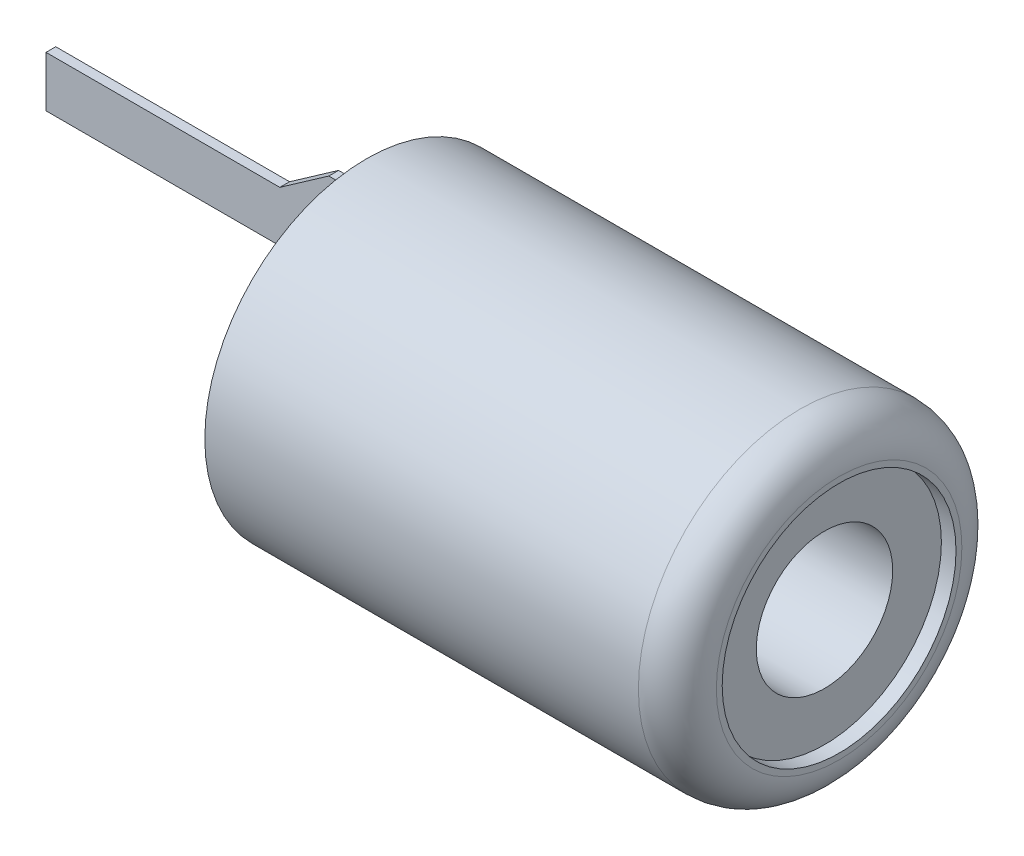
ISO-10303-21;
HEADER;
FILE_DESCRIPTION(('STEP AP214'),'2;1');
FILE_NAME('part.step','',(''),(''),'','','');
FILE_SCHEMA(('AUTOMOTIVE_DESIGN { 1 0 10303 214 1 1 1 1 }'));
ENDSEC;
DATA;
#1=APPLICATION_CONTEXT('core data for automotive mechanical design processes');
#2=APPLICATION_PROTOCOL_DEFINITION('international standard','automotive_design',2000,#1);
#3=PRODUCT_CONTEXT('',#1,'mechanical');
#4=PRODUCT('Part','Part','',(#3));
#5=PRODUCT_RELATED_PRODUCT_CATEGORY('part','',(#4));
#6=PRODUCT_DEFINITION_FORMATION('','',#4);
#7=PRODUCT_DEFINITION_CONTEXT('part definition',#1,'design');
#8=PRODUCT_DEFINITION('design','',#6,#7);
#9=PRODUCT_DEFINITION_SHAPE('','',#8);
#10=(LENGTH_UNIT() NAMED_UNIT(*) SI_UNIT(.MILLI.,.METRE.));
#11=(NAMED_UNIT(*) PLANE_ANGLE_UNIT() SI_UNIT($,.RADIAN.));
#12=(NAMED_UNIT(*) SI_UNIT($,.STERADIAN.) SOLID_ANGLE_UNIT());
#13=UNCERTAINTY_MEASURE_WITH_UNIT(LENGTH_MEASURE(1.E-05),#10,'distance_accuracy_value','');
#14=(GEOMETRIC_REPRESENTATION_CONTEXT(3) GLOBAL_UNCERTAINTY_ASSIGNED_CONTEXT((#13)) GLOBAL_UNIT_ASSIGNED_CONTEXT((#10,
#11,#12)) REPRESENTATION_CONTEXT('',''));
#15=CARTESIAN_POINT('',(0.,0.,0.));
#16=DIRECTION('',(0.,0.,1.));
#17=DIRECTION('',(1.,0.,0.));
#18=AXIS2_PLACEMENT_3D('',#15,#16,#17);
#19=CARTESIAN_POINT('',(12.3749268721822,0.,0.));
#20=DIRECTION('',(1.,0.,0.));
#21=DIRECTION('',(0.,0.,-1.));
#22=AXIS2_PLACEMENT_3D('',#19,#20,#21);
#23=CYLINDRICAL_SURFACE('',#22,3.77500000000004);
#24=CARTESIAN_POINT('',(21.7250000000001,0.,0.));
#25=DIRECTION('',(1.,0.,0.));
#26=DIRECTION('',(0.,0.,-1.));
#27=AXIS2_PLACEMENT_3D('',#24,#25,#26);
#28=CIRCLE('',#27,3.77500000000004);
#29=CARTESIAN_POINT('',(21.7250000000001,0.,-3.77500000000004));
#30=VERTEX_POINT('',#29);
#31=EDGE_CURVE('P0_E17',#30,#30,#28,.T.);
#32=ORIENTED_EDGE('',*,*,#31,.F.);
#33=EDGE_LOOP('',(#32));
#34=FACE_BOUND('',#33,.T.);
#35=CARTESIAN_POINT('',(21.1,0.,0.));
#36=DIRECTION('',(1.,0.,0.));
#37=DIRECTION('',(0.,0.,-1.));
#38=AXIS2_PLACEMENT_3D('',#35,#36,#37);
#39=CIRCLE('',#38,3.775);
#40=CARTESIAN_POINT('',(21.1,0.,-3.775));
#41=VERTEX_POINT('',#40);
#42=EDGE_CURVE('P0_E21',#41,#41,#39,.T.);
#43=ORIENTED_EDGE('',*,*,#42,.T.);
#44=EDGE_LOOP('',(#43));
#45=FACE_BOUND('',#44,.T.);
#46=ADVANCED_FACE('P0_F14',(#34,#45),#23,.T.);
#47=CARTESIAN_POINT('',(21.7250000000001,3.77500000000004,0.));
#48=DIRECTION('',(1.,0.,0.));
#49=DIRECTION('',(0.,0.,-1.));
#50=AXIS2_PLACEMENT_3D('',#47,#48,#49);
#51=PLANE('',#50);
#52=CARTESIAN_POINT('',(21.725,0.,0.));
#53=DIRECTION('',(1.,0.,0.));
#54=DIRECTION('',(0.,0.,1.));
#55=AXIS2_PLACEMENT_3D('',#52,#53,#54);
#56=CIRCLE('',#55,3.15);
#57=CARTESIAN_POINT('',(21.725,0.,3.15));
#58=VERTEX_POINT('',#57);
#59=EDGE_CURVE('P0_E10',#58,#58,#56,.F.);
#60=ORIENTED_EDGE('',*,*,#59,.T.);
#61=EDGE_LOOP('',(#60));
#62=FACE_BOUND('',#61,.T.);
#63=ORIENTED_EDGE('',*,*,#31,.T.);
#64=EDGE_LOOP('',(#63));
#65=FACE_BOUND('',#64,.T.);
#66=ADVANCED_FACE('P0_F44',(#62,#65),#51,.T.);
#67=CARTESIAN_POINT('',(21.1,0.,0.));
#68=DIRECTION('',(1.,0.,0.));
#69=DIRECTION('',(0.,0.,-1.));
#70=AXIS2_PLACEMENT_3D('',#67,#68,#69);
#71=TOROIDAL_SURFACE('',#70,3.15,0.625);
#72=ORIENTED_EDGE('',*,*,#59,.F.);
#73=EDGE_LOOP('',(#72));
#74=FACE_BOUND('',#73,.T.);
#75=ORIENTED_EDGE('',*,*,#42,.F.);
#76=EDGE_LOOP('',(#75));
#77=FACE_BOUND('',#76,.T.);
#78=ADVANCED_FACE('P0_F35',(#74,#77),#71,.F.);
#79=CLOSED_SHELL('',(#46,#66,#78));
#80=MANIFOLD_SOLID_BREP('P0_B1',#79);
#81=CARTESIAN_POINT('',(0.,-1.53,-1.75));
#82=DIRECTION('',(0.,0.,-1.));
#83=DIRECTION('',(-1.,0.,0.));
#84=AXIS2_PLACEMENT_3D('',#81,#82,#83);
#85=PLANE('',#84);
#86=DIRECTION('',(1.,0.,0.));
#87=VECTOR('',#86,1.);
#88=CARTESIAN_POINT('',(0.,0.65,-1.75));
#89=LINE('',#88,#87);
#90=CARTESIAN_POINT('',(0.,0.65,-1.75));
#91=VERTEX_POINT('',#90);
#92=CARTESIAN_POINT('',(6.,0.649999999999999,-1.75));
#93=VERTEX_POINT('',#92);
#94=EDGE_CURVE('P1_E77',#91,#93,#89,.T.);
#95=ORIENTED_EDGE('',*,*,#94,.F.);
#96=DIRECTION('',(0.,1.,0.));
#97=VECTOR('',#96,1.);
#98=CARTESIAN_POINT('',(0.,1.53,-1.75));
#99=LINE('',#98,#97);
#100=CARTESIAN_POINT('',(0.,-0.65,-1.75));
#101=VERTEX_POINT('',#100);
#102=EDGE_CURVE('P1_E130',#101,#91,#99,.T.);
#103=ORIENTED_EDGE('',*,*,#102,.F.);
#104=DIRECTION('',(1.,0.,0.));
#105=VECTOR('',#104,1.);
#106=CARTESIAN_POINT('',(0.,-0.65,-1.75));
#107=LINE('',#106,#105);
#108=CARTESIAN_POINT('',(6.,-0.65,-1.75));
#109=VERTEX_POINT('',#108);
#110=EDGE_CURVE('P1_E127',#109,#101,#107,.F.);
#111=ORIENTED_EDGE('',*,*,#110,.F.);
#112=DIRECTION('',(0.81915204428899,-0.573576436351048,0.));
#113=VECTOR('',#112,1.);
#114=CARTESIAN_POINT('',(6.,-0.65,-1.75));
#115=LINE('',#114,#113);
#116=CARTESIAN_POINT('',(7.25677024593306,-1.53,-1.75));
#117=VERTEX_POINT('',#116);
#118=EDGE_CURVE('P1_E51',#117,#109,#115,.F.);
#119=ORIENTED_EDGE('',*,*,#118,.F.);
#120=DIRECTION('',(1.,0.,0.));
#121=VECTOR('',#120,1.);
#122=CARTESIAN_POINT('',(0.,-1.53,-1.75));
#123=LINE('',#122,#121);
#124=CARTESIAN_POINT('',(9.975,-1.53,-1.75));
#125=VERTEX_POINT('',#124);
#126=EDGE_CURVE('P1_E123',#117,#125,#123,.T.);
#127=ORIENTED_EDGE('',*,*,#126,.T.);
#128=DIRECTION('',(0.,1.,0.));
#129=VECTOR('',#128,1.);
#130=CARTESIAN_POINT('',(9.975,0.,-1.75));
#131=LINE('',#130,#129);
#132=CARTESIAN_POINT('',(9.975,1.53,-1.75));
#133=VERTEX_POINT('',#132);
#134=EDGE_CURVE('P1_E18',#133,#125,#131,.F.);
#135=ORIENTED_EDGE('',*,*,#134,.F.);
#136=DIRECTION('',(1.,0.,0.));
#137=VECTOR('',#136,1.);
#138=CARTESIAN_POINT('',(0.,1.53,-1.75));
#139=LINE('',#138,#137);
#140=CARTESIAN_POINT('',(7.25677024593305,1.53,-1.75));
#141=VERTEX_POINT('',#140);
#142=EDGE_CURVE('P1_E80',#133,#141,#139,.F.);
#143=ORIENTED_EDGE('',*,*,#142,.T.);
#144=DIRECTION('',(0.81915204428899,0.573576436351048,0.));
#145=VECTOR('',#144,1.);
#146=CARTESIAN_POINT('',(6.,0.65,-1.75));
#147=LINE('',#146,#145);
#148=EDGE_CURVE('P1_E75',#93,#141,#147,.T.);
#149=ORIENTED_EDGE('',*,*,#148,.F.);
#150=EDGE_LOOP('',(#95,#103,#111,#119,#127,#135,#143,#149));
#151=FACE_BOUND('',#150,.T.);
#152=ADVANCED_FACE('P1_F15',(#151),#85,.F.);
#153=CARTESIAN_POINT('',(12.3749268721822,0.,0.));
#154=DIRECTION('',(1.,0.,0.));
#155=DIRECTION('',(0.,0.,-1.));
#156=AXIS2_PLACEMENT_3D('',#153,#154,#155);
#157=CYLINDRICAL_SURFACE('',#156,3.);
#158=CARTESIAN_POINT('',(21.725,0.,0.));
#159=DIRECTION('',(1.,0.,0.));
#160=DIRECTION('',(0.,0.,-1.));
#161=AXIS2_PLACEMENT_3D('',#158,#159,#160);
#162=CIRCLE('',#161,3.);
#163=CARTESIAN_POINT('',(21.725,0.,-3.));
#164=VERTEX_POINT('',#163);
#165=EDGE_CURVE('P1_E85',#164,#164,#162,.T.);
#166=ORIENTED_EDGE('',*,*,#165,.F.);
#167=EDGE_LOOP('',(#166));
#168=FACE_BOUND('',#167,.T.);
#169=CARTESIAN_POINT('',(22.1000000000001,0.,0.));
#170=DIRECTION('',(1.,0.,0.));
#171=DIRECTION('',(0.,0.,-1.));
#172=AXIS2_PLACEMENT_3D('',#169,#170,#171);
#173=CIRCLE('',#172,3.);
#174=CARTESIAN_POINT('',(22.1000000000001,0.,-3.));
#175=VERTEX_POINT('',#174);
#176=EDGE_CURVE('P1_E102',#175,#175,#173,.T.);
#177=ORIENTED_EDGE('',*,*,#176,.T.);
#178=EDGE_LOOP('',(#177));
#179=FACE_BOUND('',#178,.T.);
#180=ADVANCED_FACE('P1_F156',(#168,#179),#157,.F.);
#181=CARTESIAN_POINT('',(21.725,0.,0.));
#182=DIRECTION('',(1.,0.,0.));
#183=DIRECTION('',(0.,0.,-1.));
#184=AXIS2_PLACEMENT_3D('',#181,#182,#183);
#185=PLANE('',#184);
#186=CARTESIAN_POINT('',(21.725,0.,0.));
#187=DIRECTION('',(1.,0.,0.));
#188=DIRECTION('',(0.,0.,-1.));
#189=AXIS2_PLACEMENT_3D('',#186,#187,#188);
#190=CIRCLE('',#189,1.75);
#191=CARTESIAN_POINT('',(21.725,0.,-1.75));
#192=VERTEX_POINT('',#191);
#193=EDGE_CURVE('P1_E143',#192,#192,#190,.F.);
#194=ORIENTED_EDGE('',*,*,#193,.T.);
#195=EDGE_LOOP('',(#194));
#196=FACE_BOUND('',#195,.T.);
#197=ORIENTED_EDGE('',*,*,#165,.T.);
#198=EDGE_LOOP('',(#197));
#199=FACE_BOUND('',#198,.T.);
#200=ADVANCED_FACE('P1_F154',(#196,#199),#185,.T.);
#201=CARTESIAN_POINT('',(0.,0.65,-42.6242398335031));
#202=DIRECTION('',(0.,1.,0.));
#203=DIRECTION('',(0.,0.,1.));
#204=AXIS2_PLACEMENT_3D('',#201,#202,#203);
#205=PLANE('',#204);
#206=DIRECTION('',(0.,0.,1.));
#207=VECTOR('',#206,1.);
#208=CARTESIAN_POINT('',(6.,0.65,-42.6242398335031));
#209=LINE('',#208,#207);
#210=CARTESIAN_POINT('',(6.,0.65,-2.));
#211=VERTEX_POINT('',#210);
#212=EDGE_CURVE('P1_E90',#211,#93,#209,.T.);
#213=ORIENTED_EDGE('',*,*,#212,.F.);
#214=DIRECTION('',(1.,0.,0.));
#215=VECTOR('',#214,1.);
#216=CARTESIAN_POINT('',(0.,0.65,-2.));
#217=LINE('',#216,#215);
#218=CARTESIAN_POINT('',(0.,0.65,-2.));
#219=VERTEX_POINT('',#218);
#220=EDGE_CURVE('P1_E146',#211,#219,#217,.F.);
#221=ORIENTED_EDGE('',*,*,#220,.T.);
#222=DIRECTION('',(0.,0.,1.));
#223=VECTOR('',#222,1.);
#224=CARTESIAN_POINT('',(0.,0.65,-1.75));
#225=LINE('',#224,#223);
#226=EDGE_CURVE('P1_E93',#91,#219,#225,.F.);
#227=ORIENTED_EDGE('',*,*,#226,.F.);
#228=ORIENTED_EDGE('',*,*,#94,.T.);
#229=EDGE_LOOP('',(#213,#221,#227,#228));
#230=FACE_BOUND('',#229,.T.);
#231=ADVANCED_FACE('P1_F89',(#230),#205,.T.);
#232=CARTESIAN_POINT('',(0.,1.53,-1.75));
#233=DIRECTION('',(-1.,0.,0.));
#234=DIRECTION('',(0.,0.,1.));
#235=AXIS2_PLACEMENT_3D('',#232,#233,#234);
#236=PLANE('',#235);
#237=DIRECTION('',(0.,0.,1.));
#238=VECTOR('',#237,1.);
#239=CARTESIAN_POINT('',(0.,-0.65,-42.6242398335031));
#240=LINE('',#239,#238);
#241=CARTESIAN_POINT('',(0.,-0.65,-2.));
#242=VERTEX_POINT('',#241);
#243=EDGE_CURVE('P1_E120',#101,#242,#240,.F.);
#244=ORIENTED_EDGE('',*,*,#243,.F.);
#245=ORIENTED_EDGE('',*,*,#102,.T.);
#246=ORIENTED_EDGE('',*,*,#226,.T.);
#247=DIRECTION('',(0.,1.,0.));
#248=VECTOR('',#247,1.);
#249=CARTESIAN_POINT('',(0.,1.53,-2.));
#250=LINE('',#249,#248);
#251=EDGE_CURVE('P1_E264',#219,#242,#250,.F.);
#252=ORIENTED_EDGE('',*,*,#251,.T.);
#253=EDGE_LOOP('',(#244,#245,#246,#252));
#254=FACE_BOUND('',#253,.T.);
#255=ADVANCED_FACE('P1_F204',(#254),#236,.T.);
#256=CARTESIAN_POINT('',(0.,-0.65,-42.6242398335031));
#257=DIRECTION('',(0.,-1.,0.));
#258=DIRECTION('',(1.,0.,0.));
#259=AXIS2_PLACEMENT_3D('',#256,#257,#258);
#260=PLANE('',#259);
#261=ORIENTED_EDGE('',*,*,#243,.T.);
#262=DIRECTION('',(1.,0.,0.));
#263=VECTOR('',#262,1.);
#264=CARTESIAN_POINT('',(0.,-0.65,-2.));
#265=LINE('',#264,#263);
#266=CARTESIAN_POINT('',(6.,-0.65,-2.));
#267=VERTEX_POINT('',#266);
#268=EDGE_CURVE('P1_E255',#242,#267,#265,.T.);
#269=ORIENTED_EDGE('',*,*,#268,.T.);
#270=DIRECTION('',(0.,0.,1.));
#271=VECTOR('',#270,1.);
#272=CARTESIAN_POINT('',(6.,-0.65,-42.6242398335031));
#273=LINE('',#272,#271);
#274=EDGE_CURVE('P1_E119',#109,#267,#273,.F.);
#275=ORIENTED_EDGE('',*,*,#274,.F.);
#276=ORIENTED_EDGE('',*,*,#110,.T.);
#277=EDGE_LOOP('',(#261,#269,#275,#276));
#278=FACE_BOUND('',#277,.T.);
#279=ADVANCED_FACE('P1_F200',(#278),#260,.T.);
#280=CARTESIAN_POINT('',(6.,-0.65,-42.6242398335031));
#281=DIRECTION('',(-0.573576436351048,-0.81915204428899,0.));
#282=DIRECTION('',(0.81915204428899,-0.573576436351048,0.));
#283=AXIS2_PLACEMENT_3D('',#280,#281,#282);
#284=PLANE('',#283);
#285=ORIENTED_EDGE('',*,*,#274,.T.);
#286=DIRECTION('',(0.81915204428899,-0.573576436351048,0.));
#287=VECTOR('',#286,1.);
#288=CARTESIAN_POINT('',(6.,-0.65,-2.));
#289=LINE('',#288,#287);
#290=CARTESIAN_POINT('',(7.25677024593305,-1.53,-2.));
#291=VERTEX_POINT('',#290);
#292=EDGE_CURVE('P1_E240',#267,#291,#289,.T.);
#293=ORIENTED_EDGE('',*,*,#292,.T.);
#294=DIRECTION('',(0.,0.,1.));
#295=VECTOR('',#294,1.);
#296=CARTESIAN_POINT('',(7.25677024593306,-1.53,-1.75));
#297=LINE('',#296,#295);
#298=EDGE_CURVE('P1_E150',#291,#117,#297,.T.);
#299=ORIENTED_EDGE('',*,*,#298,.T.);
#300=ORIENTED_EDGE('',*,*,#118,.T.);
#301=EDGE_LOOP('',(#285,#293,#299,#300));
#302=FACE_BOUND('',#301,.T.);
#303=ADVANCED_FACE('P1_F196',(#302),#284,.T.);
#304=CARTESIAN_POINT('',(0.,-1.53,-1.75));
#305=DIRECTION('',(0.,1.,0.));
#306=DIRECTION('',(0.,0.,1.));
#307=AXIS2_PLACEMENT_3D('',#304,#305,#306);
#308=PLANE('',#307);
#309=DIRECTION('',(1.,0.,0.));
#310=VECTOR('',#309,1.);
#311=CARTESIAN_POINT('',(0.,-1.53,-2.));
#312=LINE('',#311,#310);
#313=CARTESIAN_POINT('',(9.975,-1.53,-2.));
#314=VERTEX_POINT('',#313);
#315=EDGE_CURVE('P1_E237',#291,#314,#312,.T.);
#316=ORIENTED_EDGE('',*,*,#315,.T.);
#317=DIRECTION('',(0.,0.,-1.));
#318=VECTOR('',#317,1.);
#319=CARTESIAN_POINT('',(9.975,-1.53,0.));
#320=LINE('',#319,#318);
#321=EDGE_CURVE('P1_E33',#125,#314,#320,.T.);
#322=ORIENTED_EDGE('',*,*,#321,.F.);
#323=ORIENTED_EDGE('',*,*,#126,.F.);
#324=ORIENTED_EDGE('',*,*,#298,.F.);
#325=EDGE_LOOP('',(#316,#322,#323,#324));
#326=FACE_BOUND('',#325,.T.);
#327=ADVANCED_FACE('P1_F192',(#326),#308,.F.);
#328=CARTESIAN_POINT('',(0.,1.53,-1.75));
#329=DIRECTION('',(0.,-1.,0.));
#330=DIRECTION('',(0.,0.,-1.));
#331=AXIS2_PLACEMENT_3D('',#328,#329,#330);
#332=PLANE('',#331);
#333=ORIENTED_EDGE('',*,*,#142,.F.);
#334=DIRECTION('',(0.,0.,-1.));
#335=VECTOR('',#334,1.);
#336=CARTESIAN_POINT('',(9.975,1.53,0.));
#337=LINE('',#336,#335);
#338=CARTESIAN_POINT('',(9.975,1.53,-2.));
#339=VERTEX_POINT('',#338);
#340=EDGE_CURVE('P1_E104',#339,#133,#337,.F.);
#341=ORIENTED_EDGE('',*,*,#340,.F.);
#342=DIRECTION('',(1.,0.,0.));
#343=VECTOR('',#342,1.);
#344=CARTESIAN_POINT('',(0.,1.53,-2.));
#345=LINE('',#344,#343);
#346=CARTESIAN_POINT('',(7.25677024593305,1.53,-2.));
#347=VERTEX_POINT('',#346);
#348=EDGE_CURVE('P1_E239',#339,#347,#345,.F.);
#349=ORIENTED_EDGE('',*,*,#348,.T.);
#350=DIRECTION('',(0.,0.,1.));
#351=VECTOR('',#350,1.);
#352=CARTESIAN_POINT('',(7.25677024593306,1.53,-42.6242398335031));
#353=LINE('',#352,#351);
#354=EDGE_CURVE('P1_E100',#141,#347,#353,.F.);
#355=ORIENTED_EDGE('',*,*,#354,.F.);
#356=EDGE_LOOP('',(#333,#341,#349,#355));
#357=FACE_BOUND('',#356,.T.);
#358=ADVANCED_FACE('P1_F189',(#357),#332,.F.);
#359=CARTESIAN_POINT('',(6.,0.65,-42.6242398335031));
#360=DIRECTION('',(-0.573576436351048,0.81915204428899,0.));
#361=DIRECTION('',(-0.81915204428899,-0.573576436351048,0.));
#362=AXIS2_PLACEMENT_3D('',#359,#360,#361);
#363=PLANE('',#362);
#364=ORIENTED_EDGE('',*,*,#354,.T.);
#365=DIRECTION('',(-0.81915204428899,-0.573576436351048,0.));
#366=VECTOR('',#365,1.);
#367=CARTESIAN_POINT('',(7.25677024593305,1.53,-2.));
#368=LINE('',#367,#366);
#369=EDGE_CURVE('P1_E98',#347,#211,#368,.T.);
#370=ORIENTED_EDGE('',*,*,#369,.T.);
#371=ORIENTED_EDGE('',*,*,#212,.T.);
#372=ORIENTED_EDGE('',*,*,#148,.T.);
#373=EDGE_LOOP('',(#364,#370,#371,#372));
#374=FACE_BOUND('',#373,.T.);
#375=ADVANCED_FACE('P1_F96',(#374),#363,.T.);
#376=CARTESIAN_POINT('',(22.1,3.,0.));
#377=DIRECTION('',(-1.,0.,0.));
#378=DIRECTION('',(0.,0.,1.));
#379=AXIS2_PLACEMENT_3D('',#376,#377,#378);
#380=PLANE('',#379);
#381=ORIENTED_EDGE('',*,*,#176,.F.);
#382=EDGE_LOOP('',(#381));
#383=FACE_BOUND('',#382,.T.);
#384=CARTESIAN_POINT('',(22.1,0.,0.));
#385=DIRECTION('',(-1.,0.,0.));
#386=DIRECTION('',(0.,0.,1.));
#387=AXIS2_PLACEMENT_3D('',#384,#385,#386);
#388=CIRCLE('',#387,3.15000000000007);
#389=CARTESIAN_POINT('',(22.1,0.,3.15000000000007));
#390=VERTEX_POINT('',#389);
#391=EDGE_CURVE('P1_E142',#390,#390,#388,.T.);
#392=ORIENTED_EDGE('',*,*,#391,.F.);
#393=EDGE_LOOP('',(#392));
#394=FACE_BOUND('',#393,.T.);
#395=ADVANCED_FACE('P1_F161',(#383,#394),#380,.F.);
#396=CARTESIAN_POINT('',(21.725,0.,0.));
#397=DIRECTION('',(1.,0.,0.));
#398=DIRECTION('',(0.,0.,-1.));
#399=AXIS2_PLACEMENT_3D('',#396,#397,#398);
#400=CYLINDRICAL_SURFACE('',#399,1.75);
#401=CARTESIAN_POINT('',(9.975,0.,0.));
#402=DIRECTION('',(1.,0.,0.));
#403=DIRECTION('',(0.,0.,-1.));
#404=AXIS2_PLACEMENT_3D('',#401,#402,#403);
#405=CIRCLE('',#404,1.75);
#406=CARTESIAN_POINT('',(9.975,0.,-1.75));
#407=VERTEX_POINT('',#406);
#408=EDGE_CURVE('P1_E139',#407,#407,#405,.F.);
#409=ORIENTED_EDGE('',*,*,#408,.T.);
#410=EDGE_LOOP('',(#409));
#411=FACE_BOUND('',#410,.T.);
#412=ORIENTED_EDGE('',*,*,#193,.F.);
#413=EDGE_LOOP('',(#412));
#414=FACE_BOUND('',#413,.T.);
#415=ADVANCED_FACE('P1_F164',(#411,#414),#400,.F.);
#416=CARTESIAN_POINT('',(0.,1.53,-2.));
#417=DIRECTION('',(0.,0.,1.));
#418=DIRECTION('',(1.,0.,0.));
#419=AXIS2_PLACEMENT_3D('',#416,#417,#418);
#420=PLANE('',#419);
#421=ORIENTED_EDGE('',*,*,#348,.F.);
#422=DIRECTION('',(0.,1.,0.));
#423=VECTOR('',#422,1.);
#424=CARTESIAN_POINT('',(9.975,1.53,-2.));
#425=LINE('',#424,#423);
#426=EDGE_CURVE('P1_E136',#339,#314,#425,.F.);
#427=ORIENTED_EDGE('',*,*,#426,.T.);
#428=ORIENTED_EDGE('',*,*,#315,.F.);
#429=ORIENTED_EDGE('',*,*,#292,.F.);
#430=ORIENTED_EDGE('',*,*,#268,.F.);
#431=ORIENTED_EDGE('',*,*,#251,.F.);
#432=ORIENTED_EDGE('',*,*,#220,.F.);
#433=ORIENTED_EDGE('',*,*,#369,.F.);
#434=EDGE_LOOP('',(#421,#427,#428,#429,#430,#431,#432,#433));
#435=FACE_BOUND('',#434,.T.);
#436=ADVANCED_FACE('P1_F232',(#435),#420,.F.);
#437=CARTESIAN_POINT('',(21.1,0.,0.));
#438=DIRECTION('',(-1.,0.,0.));
#439=DIRECTION('',(0.,0.,1.));
#440=AXIS2_PLACEMENT_3D('',#437,#438,#439);
#441=TOROIDAL_SURFACE('',#440,3.15000000000007,1.);
#442=CARTESIAN_POINT('',(21.1,0.,0.));
#443=DIRECTION('',(1.,0.,0.));
#444=DIRECTION('',(0.,0.,-1.));
#445=AXIS2_PLACEMENT_3D('',#442,#443,#444);
#446=CIRCLE('',#445,4.15000000000007);
#447=CARTESIAN_POINT('',(21.1,0.,-4.15000000000007));
#448=VERTEX_POINT('',#447);
#449=EDGE_CURVE('P1_E24',#448,#448,#446,.F.);
#450=ORIENTED_EDGE('',*,*,#449,.F.);
#451=EDGE_LOOP('',(#450));
#452=FACE_BOUND('',#451,.T.);
#453=ORIENTED_EDGE('',*,*,#391,.T.);
#454=EDGE_LOOP('',(#453));
#455=FACE_BOUND('',#454,.T.);
#456=ADVANCED_FACE('P1_F224',(#452,#455),#441,.T.);
#457=CARTESIAN_POINT('',(9.975,0.,0.));
#458=DIRECTION('',(1.,0.,0.));
#459=DIRECTION('',(0.,0.,-1.));
#460=AXIS2_PLACEMENT_3D('',#457,#458,#459);
#461=PLANE('',#460);
#462=ORIENTED_EDGE('',*,*,#321,.T.);
#463=ORIENTED_EDGE('',*,*,#426,.F.);
#464=ORIENTED_EDGE('',*,*,#340,.T.);
#465=ORIENTED_EDGE('',*,*,#134,.T.);
#466=EDGE_LOOP('',(#462,#463,#464,#465));
#467=FACE_BOUND('',#466,.T.);
#468=ORIENTED_EDGE('',*,*,#408,.F.);
#469=EDGE_LOOP('',(#468));
#470=FACE_BOUND('',#469,.T.);
#471=CARTESIAN_POINT('',(9.975,0.,0.));
#472=DIRECTION('',(1.,0.,0.));
#473=DIRECTION('',(0.,0.,-1.));
#474=AXIS2_PLACEMENT_3D('',#471,#472,#473);
#475=CIRCLE('',#474,4.15000000000007);
#476=CARTESIAN_POINT('',(9.975,0.,-4.15000000000007));
#477=VERTEX_POINT('',#476);
#478=EDGE_CURVE('P1_E10',#477,#477,#475,.T.);
#479=ORIENTED_EDGE('',*,*,#478,.F.);
#480=EDGE_LOOP('',(#479));
#481=FACE_BOUND('',#480,.T.);
#482=ADVANCED_FACE('P1_F218',(#467,#470,#481),#461,.F.);
#483=CARTESIAN_POINT('',(12.3749268721822,0.,0.));
#484=DIRECTION('',(1.,0.,0.));
#485=DIRECTION('',(0.,0.,-1.));
#486=AXIS2_PLACEMENT_3D('',#483,#484,#485);
#487=CYLINDRICAL_SURFACE('',#486,4.15000000000007);
#488=ORIENTED_EDGE('',*,*,#449,.T.);
#489=EDGE_LOOP('',(#488));
#490=FACE_BOUND('',#489,.T.);
#491=ORIENTED_EDGE('',*,*,#478,.T.);
#492=EDGE_LOOP('',(#491));
#493=FACE_BOUND('',#492,.T.);
#494=ADVANCED_FACE('P1_F216',(#490,#493),#487,.T.);
#495=CLOSED_SHELL('',(#152,#180,#200,#231,#255,#279,#303,#327,#358,#375,#395,#415,#436,#456,
#482,#494));
#496=MANIFOLD_SOLID_BREP('P1_B1',#495);
#497=ADVANCED_BREP_SHAPE_REPRESENTATION('',(#18,#80,#496),#14);
#498=SHAPE_DEFINITION_REPRESENTATION(#9,#497);
ENDSEC;
END-ISO-10303-21;
